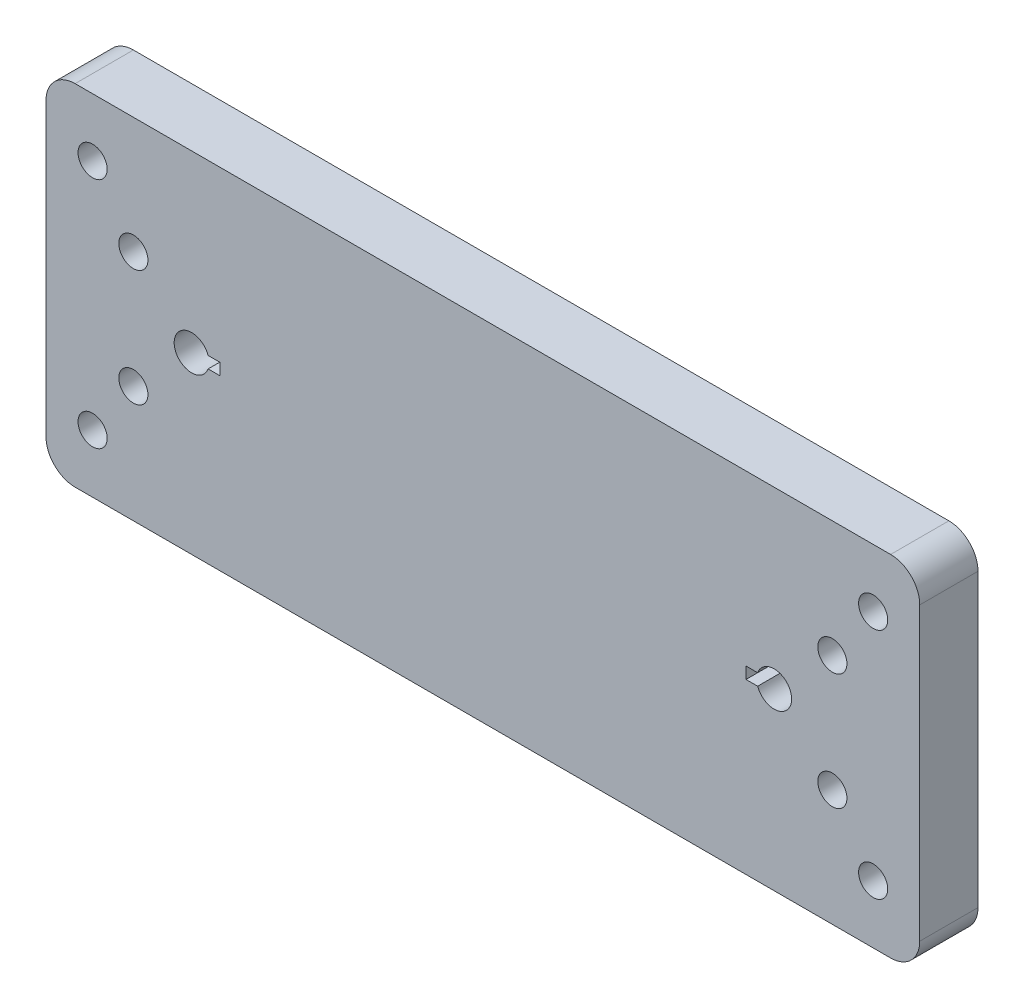
ISO-10303-21;
HEADER;
FILE_DESCRIPTION(('STEP AP214'),'2;1');
FILE_NAME('part.step','',(''),(''),'','','');
FILE_SCHEMA(('AUTOMOTIVE_DESIGN { 1 0 10303 214 1 1 1 1 }'));
ENDSEC;
DATA;
#1=APPLICATION_CONTEXT('core data for automotive mechanical design processes');
#2=APPLICATION_PROTOCOL_DEFINITION('international standard','automotive_design',2000,#1);
#3=PRODUCT_CONTEXT('',#1,'mechanical');
#4=PRODUCT('Part','Part','',(#3));
#5=PRODUCT_RELATED_PRODUCT_CATEGORY('part','',(#4));
#6=PRODUCT_DEFINITION_FORMATION('','',#4);
#7=PRODUCT_DEFINITION_CONTEXT('part definition',#1,'design');
#8=PRODUCT_DEFINITION('design','',#6,#7);
#9=PRODUCT_DEFINITION_SHAPE('','',#8);
#10=(LENGTH_UNIT() NAMED_UNIT(*) SI_UNIT(.MILLI.,.METRE.));
#11=(NAMED_UNIT(*) PLANE_ANGLE_UNIT() SI_UNIT($,.RADIAN.));
#12=(NAMED_UNIT(*) SI_UNIT($,.STERADIAN.) SOLID_ANGLE_UNIT());
#13=UNCERTAINTY_MEASURE_WITH_UNIT(LENGTH_MEASURE(1.E-05),#10,'distance_accuracy_value','');
#14=(GEOMETRIC_REPRESENTATION_CONTEXT(3) GLOBAL_UNCERTAINTY_ASSIGNED_CONTEXT((#13)) GLOBAL_UNIT_ASSIGNED_CONTEXT((#10,
#11,#12)) REPRESENTATION_CONTEXT('',''));
#15=CARTESIAN_POINT('',(0.,0.,0.));
#16=DIRECTION('',(0.,0.,1.));
#17=DIRECTION('',(1.,0.,0.));
#18=AXIS2_PLACEMENT_3D('',#15,#16,#17);
#19=CARTESIAN_POINT('',(145.,5.,10.));
#20=DIRECTION('',(0.,0.,1.));
#21=DIRECTION('',(1.,0.,0.));
#22=AXIS2_PLACEMENT_3D('',#19,#20,#21);
#23=PLANE('',#22);
#24=CARTESIAN_POINT('',(8.00000000000001,10.,10.));
#25=DIRECTION('',(0.,0.,1.));
#26=DIRECTION('',(1.,0.,0.));
#27=AXIS2_PLACEMENT_3D('',#24,#25,#26);
#28=CIRCLE('',#27,2.5);
#29=CARTESIAN_POINT('',(10.5,10.,10.));
#30=VERTEX_POINT('',#29);
#31=EDGE_CURVE('E422',#30,#30,#28,.T.);
#32=ORIENTED_EDGE('',*,*,#31,.F.);
#33=EDGE_LOOP('',(#32));
#34=FACE_BOUND('',#33,.T.);
#35=CARTESIAN_POINT('',(142.,50.,10.));
#36=DIRECTION('',(0.,0.,1.));
#37=DIRECTION('',(1.,0.,0.));
#38=AXIS2_PLACEMENT_3D('',#35,#36,#37);
#39=CIRCLE('',#38,2.5);
#40=CARTESIAN_POINT('',(144.5,50.,10.));
#41=VERTEX_POINT('',#40);
#42=EDGE_CURVE('E415',#41,#41,#39,.T.);
#43=ORIENTED_EDGE('',*,*,#42,.F.);
#44=EDGE_LOOP('',(#43));
#45=FACE_BOUND('',#44,.T.);
#46=CARTESIAN_POINT('',(142.,10.,10.));
#47=DIRECTION('',(0.,0.,1.));
#48=DIRECTION('',(1.,0.,0.));
#49=AXIS2_PLACEMENT_3D('',#46,#47,#48);
#50=CIRCLE('',#49,2.5);
#51=CARTESIAN_POINT('',(144.5,10.,10.));
#52=VERTEX_POINT('',#51);
#53=EDGE_CURVE('E412',#52,#52,#50,.T.);
#54=ORIENTED_EDGE('',*,*,#53,.F.);
#55=EDGE_LOOP('',(#54));
#56=FACE_BOUND('',#55,.T.);
#57=CARTESIAN_POINT('',(8.,50.,10.));
#58=DIRECTION('',(0.,0.,1.));
#59=DIRECTION('',(1.,0.,0.));
#60=AXIS2_PLACEMENT_3D('',#57,#58,#59);
#61=CIRCLE('',#60,2.5);
#62=CARTESIAN_POINT('',(10.5,50.,10.));
#63=VERTEX_POINT('',#62);
#64=EDGE_CURVE('E421',#63,#63,#61,.T.);
#65=ORIENTED_EDGE('',*,*,#64,.F.);
#66=EDGE_LOOP('',(#65));
#67=FACE_BOUND('',#66,.T.);
#68=CARTESIAN_POINT('',(15.,20.,10.));
#69=DIRECTION('',(0.,0.,1.));
#70=DIRECTION('',(1.,0.,0.));
#71=AXIS2_PLACEMENT_3D('',#68,#69,#70);
#72=CIRCLE('',#71,2.5);
#73=CARTESIAN_POINT('',(17.5,20.,10.));
#74=VERTEX_POINT('',#73);
#75=EDGE_CURVE('E446',#74,#74,#72,.T.);
#76=ORIENTED_EDGE('',*,*,#75,.F.);
#77=EDGE_LOOP('',(#76));
#78=FACE_BOUND('',#77,.T.);
#79=CARTESIAN_POINT('',(135.,40.,10.));
#80=DIRECTION('',(0.,0.,1.));
#81=DIRECTION('',(1.,0.,0.));
#82=AXIS2_PLACEMENT_3D('',#79,#80,#81);
#83=CIRCLE('',#82,2.5);
#84=CARTESIAN_POINT('',(137.5,40.,10.));
#85=VERTEX_POINT('',#84);
#86=EDGE_CURVE('E439',#85,#85,#83,.T.);
#87=ORIENTED_EDGE('',*,*,#86,.F.);
#88=EDGE_LOOP('',(#87));
#89=FACE_BOUND('',#88,.T.);
#90=CARTESIAN_POINT('',(135.,20.,10.));
#91=DIRECTION('',(0.,0.,1.));
#92=DIRECTION('',(1.,0.,0.));
#93=AXIS2_PLACEMENT_3D('',#90,#91,#92);
#94=CIRCLE('',#93,2.5);
#95=CARTESIAN_POINT('',(137.5,20.,10.));
#96=VERTEX_POINT('',#95);
#97=EDGE_CURVE('E433',#96,#96,#94,.T.);
#98=ORIENTED_EDGE('',*,*,#97,.F.);
#99=EDGE_LOOP('',(#98));
#100=FACE_BOUND('',#99,.T.);
#101=CARTESIAN_POINT('',(15.,40.,10.));
#102=DIRECTION('',(0.,0.,1.));
#103=DIRECTION('',(1.,0.,0.));
#104=AXIS2_PLACEMENT_3D('',#101,#102,#103);
#105=CIRCLE('',#104,2.5);
#106=CARTESIAN_POINT('',(17.5,40.,10.));
#107=VERTEX_POINT('',#106);
#108=EDGE_CURVE('E445',#107,#107,#105,.T.);
#109=ORIENTED_EDGE('',*,*,#108,.F.);
#110=EDGE_LOOP('',(#109));
#111=FACE_BOUND('',#110,.T.);
#112=CARTESIAN_POINT('',(145.,5.,10.));
#113=DIRECTION('',(0.,0.,1.));
#114=DIRECTION('',(1.,0.,0.));
#115=AXIS2_PLACEMENT_3D('',#112,#113,#114);
#116=CIRCLE('',#115,5.);
#117=CARTESIAN_POINT('',(145.,0.,10.));
#118=VERTEX_POINT('',#117);
#119=CARTESIAN_POINT('',(150.,5.00000000000004,10.));
#120=VERTEX_POINT('',#119);
#121=EDGE_CURVE('E215',#118,#120,#116,.T.);
#122=ORIENTED_EDGE('',*,*,#121,.T.);
#123=DIRECTION('',(0.,1.,0.));
#124=VECTOR('',#123,1.);
#125=CARTESIAN_POINT('',(150.,5.00000000000004,10.));
#126=LINE('',#125,#124);
#127=CARTESIAN_POINT('',(150.,55.,10.));
#128=VERTEX_POINT('',#127);
#129=EDGE_CURVE('E218',#120,#128,#126,.T.);
#130=ORIENTED_EDGE('',*,*,#129,.T.);
#131=CARTESIAN_POINT('',(145.,55.,10.));
#132=DIRECTION('',(0.,0.,1.));
#133=DIRECTION('',(-1.,0.,0.));
#134=AXIS2_PLACEMENT_3D('',#131,#132,#133);
#135=CIRCLE('',#134,5.);
#136=CARTESIAN_POINT('',(145.,60.,10.));
#137=VERTEX_POINT('',#136);
#138=EDGE_CURVE('E221',#128,#137,#135,.T.);
#139=ORIENTED_EDGE('',*,*,#138,.T.);
#140=DIRECTION('',(-1.,0.,0.));
#141=VECTOR('',#140,1.);
#142=CARTESIAN_POINT('',(5.00000000000004,60.,10.));
#143=LINE('',#142,#141);
#144=CARTESIAN_POINT('',(5.00000000000004,60.,10.));
#145=VERTEX_POINT('',#144);
#146=EDGE_CURVE('E223',#137,#145,#143,.T.);
#147=ORIENTED_EDGE('',*,*,#146,.T.);
#148=CARTESIAN_POINT('',(5.,55.,10.));
#149=DIRECTION('',(0.,0.,1.));
#150=DIRECTION('',(-1.,0.,0.));
#151=AXIS2_PLACEMENT_3D('',#148,#149,#150);
#152=CIRCLE('',#151,5.);
#153=CARTESIAN_POINT('',(0.,55.,10.));
#154=VERTEX_POINT('',#153);
#155=EDGE_CURVE('E225',#145,#154,#152,.T.);
#156=ORIENTED_EDGE('',*,*,#155,.T.);
#157=DIRECTION('',(0.,-1.,0.));
#158=VECTOR('',#157,1.);
#159=CARTESIAN_POINT('',(0.,5.00000000000004,10.));
#160=LINE('',#159,#158);
#161=CARTESIAN_POINT('',(0.,5.,10.));
#162=VERTEX_POINT('',#161);
#163=EDGE_CURVE('E227',#154,#162,#160,.T.);
#164=ORIENTED_EDGE('',*,*,#163,.T.);
#165=CARTESIAN_POINT('',(5.,5.,10.));
#166=DIRECTION('',(0.,0.,1.));
#167=DIRECTION('',(-1.,0.,0.));
#168=AXIS2_PLACEMENT_3D('',#165,#166,#167);
#169=CIRCLE('',#168,5.);
#170=CARTESIAN_POINT('',(5.00000000000004,0.,10.));
#171=VERTEX_POINT('',#170);
#172=EDGE_CURVE('E229',#162,#171,#169,.T.);
#173=ORIENTED_EDGE('',*,*,#172,.T.);
#174=DIRECTION('',(1.,0.,0.));
#175=VECTOR('',#174,1.);
#176=CARTESIAN_POINT('',(5.00000000000004,0.,10.));
#177=LINE('',#176,#175);
#178=EDGE_CURVE('E231',#171,#118,#177,.T.);
#179=ORIENTED_EDGE('',*,*,#178,.T.);
#180=EDGE_LOOP('',(#122,#130,#139,#147,#156,#164,#173,#179));
#181=FACE_BOUND('',#180,.T.);
#182=DIRECTION('',(-1.,0.,0.));
#183=VECTOR('',#182,1.);
#184=CARTESIAN_POINT('',(122.171572875254,31.,10.));
#185=LINE('',#184,#183);
#186=CARTESIAN_POINT('',(122.171572875254,31.,10.));
#187=VERTEX_POINT('',#186);
#188=CARTESIAN_POINT('',(120.171572875254,31.,10.));
#189=VERTEX_POINT('',#188);
#190=EDGE_CURVE('E186',#187,#189,#185,.T.);
#191=ORIENTED_EDGE('',*,*,#190,.F.);
#192=CARTESIAN_POINT('',(125.,30.,10.));
#193=DIRECTION('',(0.,0.,1.));
#194=DIRECTION('',(1.,0.,0.));
#195=AXIS2_PLACEMENT_3D('',#192,#193,#194);
#196=CIRCLE('',#195,3.);
#197=CARTESIAN_POINT('',(122.171572875254,29.,10.));
#198=VERTEX_POINT('',#197);
#199=EDGE_CURVE('E184',#198,#187,#196,.T.);
#200=ORIENTED_EDGE('',*,*,#199,.F.);
#201=DIRECTION('',(1.,0.,0.));
#202=VECTOR('',#201,1.);
#203=CARTESIAN_POINT('',(122.171572875254,29.,10.));
#204=LINE('',#203,#202);
#205=CARTESIAN_POINT('',(120.171572875254,29.,10.));
#206=VERTEX_POINT('',#205);
#207=EDGE_CURVE('E192',#206,#198,#204,.T.);
#208=ORIENTED_EDGE('',*,*,#207,.F.);
#209=DIRECTION('',(0.,-1.,0.));
#210=VECTOR('',#209,1.);
#211=CARTESIAN_POINT('',(120.171572875254,31.,10.));
#212=LINE('',#211,#210);
#213=EDGE_CURVE('E189',#189,#206,#212,.T.);
#214=ORIENTED_EDGE('',*,*,#213,.F.);
#215=EDGE_LOOP('',(#191,#200,#208,#214));
#216=FACE_BOUND('',#215,.T.);
#217=DIRECTION('',(1.,0.,0.));
#218=VECTOR('',#217,1.);
#219=CARTESIAN_POINT('',(27.8284271247462,29.,10.));
#220=LINE('',#219,#218);
#221=CARTESIAN_POINT('',(27.8284271247462,29.,10.));
#222=VERTEX_POINT('',#221);
#223=CARTESIAN_POINT('',(29.8284271247462,29.,10.));
#224=VERTEX_POINT('',#223);
#225=EDGE_CURVE('E154',#222,#224,#220,.T.);
#226=ORIENTED_EDGE('',*,*,#225,.F.);
#227=CARTESIAN_POINT('',(25.,30.,10.));
#228=DIRECTION('',(0.,0.,1.));
#229=DIRECTION('',(1.,0.,0.));
#230=AXIS2_PLACEMENT_3D('',#227,#228,#229);
#231=CIRCLE('',#230,3.);
#232=CARTESIAN_POINT('',(27.8284271247462,31.,10.));
#233=VERTEX_POINT('',#232);
#234=EDGE_CURVE('E146',#233,#222,#231,.T.);
#235=ORIENTED_EDGE('',*,*,#234,.F.);
#236=DIRECTION('',(-1.,0.,0.));
#237=VECTOR('',#236,1.);
#238=CARTESIAN_POINT('',(27.8284271247462,31.,10.));
#239=LINE('',#238,#237);
#240=CARTESIAN_POINT('',(29.8284271247462,31.,10.));
#241=VERTEX_POINT('',#240);
#242=EDGE_CURVE('E168',#241,#233,#239,.T.);
#243=ORIENTED_EDGE('',*,*,#242,.F.);
#244=DIRECTION('',(0.,1.,0.));
#245=VECTOR('',#244,1.);
#246=CARTESIAN_POINT('',(29.8284271247462,31.,10.));
#247=LINE('',#246,#245);
#248=EDGE_CURVE('E166',#224,#241,#247,.T.);
#249=ORIENTED_EDGE('',*,*,#248,.F.);
#250=EDGE_LOOP('',(#226,#235,#243,#249));
#251=FACE_BOUND('',#250,.T.);
#252=ADVANCED_FACE('F33',(#34,#45,#56,#67,#78,#89,#100,#111,#181,#216,#251),#23,.T.);
#253=CARTESIAN_POINT('',(145.,5.,0.));
#254=DIRECTION('',(0.,0.,1.));
#255=DIRECTION('',(1.,0.,0.));
#256=AXIS2_PLACEMENT_3D('',#253,#254,#255);
#257=PLANE('',#256);
#258=CARTESIAN_POINT('',(8.00000000000001,10.,0.));
#259=DIRECTION('',(0.,0.,1.));
#260=DIRECTION('',(1.,0.,0.));
#261=AXIS2_PLACEMENT_3D('',#258,#259,#260);
#262=CIRCLE('',#261,2.5);
#263=CARTESIAN_POINT('',(10.5,10.,0.));
#264=VERTEX_POINT('',#263);
#265=EDGE_CURVE('E418',#264,#264,#262,.T.);
#266=ORIENTED_EDGE('',*,*,#265,.T.);
#267=EDGE_LOOP('',(#266));
#268=FACE_BOUND('',#267,.T.);
#269=CARTESIAN_POINT('',(142.,50.,0.));
#270=DIRECTION('',(0.,0.,1.));
#271=DIRECTION('',(1.,0.,0.));
#272=AXIS2_PLACEMENT_3D('',#269,#270,#271);
#273=CIRCLE('',#272,2.5);
#274=CARTESIAN_POINT('',(144.5,50.,0.));
#275=VERTEX_POINT('',#274);
#276=EDGE_CURVE('E425',#275,#275,#273,.T.);
#277=ORIENTED_EDGE('',*,*,#276,.T.);
#278=EDGE_LOOP('',(#277));
#279=FACE_BOUND('',#278,.T.);
#280=CARTESIAN_POINT('',(142.,10.,0.));
#281=DIRECTION('',(0.,0.,1.));
#282=DIRECTION('',(1.,0.,0.));
#283=AXIS2_PLACEMENT_3D('',#280,#281,#282);
#284=CIRCLE('',#283,2.5);
#285=CARTESIAN_POINT('',(144.5,10.,0.));
#286=VERTEX_POINT('',#285);
#287=EDGE_CURVE('E409',#286,#286,#284,.T.);
#288=ORIENTED_EDGE('',*,*,#287,.T.);
#289=EDGE_LOOP('',(#288));
#290=FACE_BOUND('',#289,.T.);
#291=CARTESIAN_POINT('',(8.,50.,0.));
#292=DIRECTION('',(0.,0.,1.));
#293=DIRECTION('',(1.,0.,0.));
#294=AXIS2_PLACEMENT_3D('',#291,#292,#293);
#295=CIRCLE('',#294,2.5);
#296=CARTESIAN_POINT('',(10.5,50.,0.));
#297=VERTEX_POINT('',#296);
#298=EDGE_CURVE('E430',#297,#297,#295,.T.);
#299=ORIENTED_EDGE('',*,*,#298,.T.);
#300=EDGE_LOOP('',(#299));
#301=FACE_BOUND('',#300,.T.);
#302=CARTESIAN_POINT('',(15.,20.,0.));
#303=DIRECTION('',(0.,0.,1.));
#304=DIRECTION('',(1.,0.,0.));
#305=AXIS2_PLACEMENT_3D('',#302,#303,#304);
#306=CIRCLE('',#305,2.5);
#307=CARTESIAN_POINT('',(17.5,20.,0.));
#308=VERTEX_POINT('',#307);
#309=EDGE_CURVE('E442',#308,#308,#306,.T.);
#310=ORIENTED_EDGE('',*,*,#309,.T.);
#311=EDGE_LOOP('',(#310));
#312=FACE_BOUND('',#311,.T.);
#313=CARTESIAN_POINT('',(135.,40.,0.));
#314=DIRECTION('',(0.,0.,1.));
#315=DIRECTION('',(1.,0.,0.));
#316=AXIS2_PLACEMENT_3D('',#313,#314,#315);
#317=CIRCLE('',#316,2.5);
#318=CARTESIAN_POINT('',(137.5,40.,0.));
#319=VERTEX_POINT('',#318);
#320=EDGE_CURVE('E449',#319,#319,#317,.T.);
#321=ORIENTED_EDGE('',*,*,#320,.T.);
#322=EDGE_LOOP('',(#321));
#323=FACE_BOUND('',#322,.T.);
#324=CARTESIAN_POINT('',(135.,20.,0.));
#325=DIRECTION('',(0.,0.,1.));
#326=DIRECTION('',(1.,0.,0.));
#327=AXIS2_PLACEMENT_3D('',#324,#325,#326);
#328=CIRCLE('',#327,2.5);
#329=CARTESIAN_POINT('',(137.5,20.,0.));
#330=VERTEX_POINT('',#329);
#331=EDGE_CURVE('E436',#330,#330,#328,.T.);
#332=ORIENTED_EDGE('',*,*,#331,.T.);
#333=EDGE_LOOP('',(#332));
#334=FACE_BOUND('',#333,.T.);
#335=CARTESIAN_POINT('',(15.,40.,0.));
#336=DIRECTION('',(0.,0.,1.));
#337=DIRECTION('',(1.,0.,0.));
#338=AXIS2_PLACEMENT_3D('',#335,#336,#337);
#339=CIRCLE('',#338,2.5);
#340=CARTESIAN_POINT('',(17.5,40.,0.));
#341=VERTEX_POINT('',#340);
#342=EDGE_CURVE('E174',#341,#341,#339,.T.);
#343=ORIENTED_EDGE('',*,*,#342,.T.);
#344=EDGE_LOOP('',(#343));
#345=FACE_BOUND('',#344,.T.);
#346=CARTESIAN_POINT('',(125.,30.,0.));
#347=DIRECTION('',(0.,0.,1.));
#348=DIRECTION('',(1.,0.,0.));
#349=AXIS2_PLACEMENT_3D('',#346,#347,#348);
#350=CIRCLE('',#349,3.);
#351=CARTESIAN_POINT('',(122.171572875254,29.,0.));
#352=VERTEX_POINT('',#351);
#353=CARTESIAN_POINT('',(122.171572875254,31.,0.));
#354=VERTEX_POINT('',#353);
#355=EDGE_CURVE('E162',#352,#354,#350,.T.);
#356=ORIENTED_EDGE('',*,*,#355,.T.);
#357=DIRECTION('',(-1.,0.,0.));
#358=VECTOR('',#357,1.);
#359=CARTESIAN_POINT('',(122.171572875254,31.,0.));
#360=LINE('',#359,#358);
#361=CARTESIAN_POINT('',(120.171572875254,31.,0.));
#362=VERTEX_POINT('',#361);
#363=EDGE_CURVE('E197',#354,#362,#360,.T.);
#364=ORIENTED_EDGE('',*,*,#363,.T.);
#365=DIRECTION('',(0.,-1.,0.));
#366=VECTOR('',#365,1.);
#367=CARTESIAN_POINT('',(120.171572875254,31.,0.));
#368=LINE('',#367,#366);
#369=CARTESIAN_POINT('',(120.171572875254,29.,0.));
#370=VERTEX_POINT('',#369);
#371=EDGE_CURVE('E200',#362,#370,#368,.T.);
#372=ORIENTED_EDGE('',*,*,#371,.T.);
#373=DIRECTION('',(1.,0.,0.));
#374=VECTOR('',#373,1.);
#375=CARTESIAN_POINT('',(122.171572875254,29.,0.));
#376=LINE('',#375,#374);
#377=EDGE_CURVE('E187',#370,#352,#376,.T.);
#378=ORIENTED_EDGE('',*,*,#377,.T.);
#379=EDGE_LOOP('',(#356,#364,#372,#378));
#380=FACE_BOUND('',#379,.T.);
#381=CARTESIAN_POINT('',(145.,5.,0.));
#382=DIRECTION('',(0.,0.,1.));
#383=DIRECTION('',(1.,0.,0.));
#384=AXIS2_PLACEMENT_3D('',#381,#382,#383);
#385=CIRCLE('',#384,5.);
#386=CARTESIAN_POINT('',(145.,0.,0.));
#387=VERTEX_POINT('',#386);
#388=CARTESIAN_POINT('',(150.,5.00000000000004,0.));
#389=VERTEX_POINT('',#388);
#390=EDGE_CURVE('E214',#387,#389,#385,.T.);
#391=ORIENTED_EDGE('',*,*,#390,.F.);
#392=DIRECTION('',(1.,0.,0.));
#393=VECTOR('',#392,1.);
#394=CARTESIAN_POINT('',(5.00000000000004,0.,0.));
#395=LINE('',#394,#393);
#396=CARTESIAN_POINT('',(5.00000000000004,0.,0.));
#397=VERTEX_POINT('',#396);
#398=EDGE_CURVE('E219',#397,#387,#395,.T.);
#399=ORIENTED_EDGE('',*,*,#398,.F.);
#400=CARTESIAN_POINT('',(5.,5.,0.));
#401=DIRECTION('',(0.,0.,1.));
#402=DIRECTION('',(-1.,0.,0.));
#403=AXIS2_PLACEMENT_3D('',#400,#401,#402);
#404=CIRCLE('',#403,5.);
#405=CARTESIAN_POINT('',(0.,5.,0.));
#406=VERTEX_POINT('',#405);
#407=EDGE_CURVE('E246',#406,#397,#404,.T.);
#408=ORIENTED_EDGE('',*,*,#407,.F.);
#409=DIRECTION('',(0.,-1.,0.));
#410=VECTOR('',#409,1.);
#411=CARTESIAN_POINT('',(0.,5.00000000000004,0.));
#412=LINE('',#411,#410);
#413=CARTESIAN_POINT('',(0.,55.,0.));
#414=VERTEX_POINT('',#413);
#415=EDGE_CURVE('E244',#414,#406,#412,.T.);
#416=ORIENTED_EDGE('',*,*,#415,.F.);
#417=CARTESIAN_POINT('',(5.,55.,0.));
#418=DIRECTION('',(0.,0.,1.));
#419=DIRECTION('',(-1.,0.,0.));
#420=AXIS2_PLACEMENT_3D('',#417,#418,#419);
#421=CIRCLE('',#420,5.);
#422=CARTESIAN_POINT('',(5.00000000000004,60.,0.));
#423=VERTEX_POINT('',#422);
#424=EDGE_CURVE('E242',#423,#414,#421,.T.);
#425=ORIENTED_EDGE('',*,*,#424,.F.);
#426=DIRECTION('',(-1.,0.,0.));
#427=VECTOR('',#426,1.);
#428=CARTESIAN_POINT('',(5.00000000000004,60.,0.));
#429=LINE('',#428,#427);
#430=CARTESIAN_POINT('',(145.,60.,0.));
#431=VERTEX_POINT('',#430);
#432=EDGE_CURVE('E240',#431,#423,#429,.T.);
#433=ORIENTED_EDGE('',*,*,#432,.F.);
#434=CARTESIAN_POINT('',(145.,55.,0.));
#435=DIRECTION('',(0.,0.,1.));
#436=DIRECTION('',(-1.,0.,0.));
#437=AXIS2_PLACEMENT_3D('',#434,#435,#436);
#438=CIRCLE('',#437,5.);
#439=CARTESIAN_POINT('',(150.,55.,0.));
#440=VERTEX_POINT('',#439);
#441=EDGE_CURVE('E238',#440,#431,#438,.T.);
#442=ORIENTED_EDGE('',*,*,#441,.F.);
#443=DIRECTION('',(0.,1.,0.));
#444=VECTOR('',#443,1.);
#445=CARTESIAN_POINT('',(150.,5.00000000000004,0.));
#446=LINE('',#445,#444);
#447=EDGE_CURVE('E236',#389,#440,#446,.T.);
#448=ORIENTED_EDGE('',*,*,#447,.F.);
#449=EDGE_LOOP('',(#391,#399,#408,#416,#425,#433,#442,#448));
#450=FACE_BOUND('',#449,.T.);
#451=CARTESIAN_POINT('',(25.,30.,0.));
#452=DIRECTION('',(0.,0.,1.));
#453=DIRECTION('',(1.,0.,0.));
#454=AXIS2_PLACEMENT_3D('',#451,#452,#453);
#455=CIRCLE('',#454,3.);
#456=CARTESIAN_POINT('',(27.8284271247462,31.,0.));
#457=VERTEX_POINT('',#456);
#458=CARTESIAN_POINT('',(27.8284271247462,29.,0.));
#459=VERTEX_POINT('',#458);
#460=EDGE_CURVE('E56',#457,#459,#455,.T.);
#461=ORIENTED_EDGE('',*,*,#460,.T.);
#462=DIRECTION('',(1.,0.,0.));
#463=VECTOR('',#462,1.);
#464=CARTESIAN_POINT('',(27.8284271247462,29.,0.));
#465=LINE('',#464,#463);
#466=CARTESIAN_POINT('',(29.8284271247462,29.,0.));
#467=VERTEX_POINT('',#466);
#468=EDGE_CURVE('E161',#459,#467,#465,.T.);
#469=ORIENTED_EDGE('',*,*,#468,.T.);
#470=DIRECTION('',(0.,1.,0.));
#471=VECTOR('',#470,1.);
#472=CARTESIAN_POINT('',(29.8284271247462,31.,0.));
#473=LINE('',#472,#471);
#474=CARTESIAN_POINT('',(29.8284271247462,31.,0.));
#475=VERTEX_POINT('',#474);
#476=EDGE_CURVE('E176',#467,#475,#473,.T.);
#477=ORIENTED_EDGE('',*,*,#476,.T.);
#478=DIRECTION('',(-1.,0.,0.));
#479=VECTOR('',#478,1.);
#480=CARTESIAN_POINT('',(27.8284271247462,31.,0.));
#481=LINE('',#480,#479);
#482=EDGE_CURVE('E155',#475,#457,#481,.T.);
#483=ORIENTED_EDGE('',*,*,#482,.T.);
#484=EDGE_LOOP('',(#461,#469,#477,#483));
#485=FACE_BOUND('',#484,.T.);
#486=ADVANCED_FACE('F276',(#268,#279,#290,#301,#312,#323,#334,#345,#380,#450,#485),#257,.F.);
#487=CARTESIAN_POINT('',(145.,5.,10.));
#488=DIRECTION('',(0.,0.,-1.));
#489=DIRECTION('',(-1.,0.,0.));
#490=AXIS2_PLACEMENT_3D('',#487,#488,#489);
#491=CYLINDRICAL_SURFACE('',#490,5.);
#492=ORIENTED_EDGE('',*,*,#390,.T.);
#493=DIRECTION('',(0.,0.,-1.));
#494=VECTOR('',#493,1.);
#495=CARTESIAN_POINT('',(150.,5.00000000000004,10.));
#496=LINE('',#495,#494);
#497=EDGE_CURVE('E11',#120,#389,#496,.T.);
#498=ORIENTED_EDGE('',*,*,#497,.F.);
#499=ORIENTED_EDGE('',*,*,#121,.F.);
#500=DIRECTION('',(0.,0.,-1.));
#501=VECTOR('',#500,1.);
#502=CARTESIAN_POINT('',(145.,0.,10.));
#503=LINE('',#502,#501);
#504=EDGE_CURVE('E233',#118,#387,#503,.T.);
#505=ORIENTED_EDGE('',*,*,#504,.T.);
#506=EDGE_LOOP('',(#492,#498,#499,#505));
#507=FACE_BOUND('',#506,.T.);
#508=ADVANCED_FACE('F35',(#507),#491,.T.);
#509=CARTESIAN_POINT('',(150.,5.00000000000004,10.));
#510=DIRECTION('',(-1.,0.,0.));
#511=DIRECTION('',(0.,0.,1.));
#512=AXIS2_PLACEMENT_3D('',#509,#510,#511);
#513=PLANE('',#512);
#514=ORIENTED_EDGE('',*,*,#447,.T.);
#515=DIRECTION('',(0.,0.,-1.));
#516=VECTOR('',#515,1.);
#517=CARTESIAN_POINT('',(150.,55.,10.));
#518=LINE('',#517,#516);
#519=EDGE_CURVE('E41',#128,#440,#518,.T.);
#520=ORIENTED_EDGE('',*,*,#519,.F.);
#521=ORIENTED_EDGE('',*,*,#129,.F.);
#522=ORIENTED_EDGE('',*,*,#497,.T.);
#523=EDGE_LOOP('',(#514,#520,#521,#522));
#524=FACE_BOUND('',#523,.T.);
#525=ADVANCED_FACE('F294',(#524),#513,.F.);
#526=CARTESIAN_POINT('',(145.,55.,10.));
#527=DIRECTION('',(0.,0.,-1.));
#528=DIRECTION('',(-1.,0.,0.));
#529=AXIS2_PLACEMENT_3D('',#526,#527,#528);
#530=CYLINDRICAL_SURFACE('',#529,5.);
#531=ORIENTED_EDGE('',*,*,#441,.T.);
#532=DIRECTION('',(0.,0.,-1.));
#533=VECTOR('',#532,1.);
#534=CARTESIAN_POINT('',(145.,60.,10.));
#535=LINE('',#534,#533);
#536=EDGE_CURVE('E263',#137,#431,#535,.T.);
#537=ORIENTED_EDGE('',*,*,#536,.F.);
#538=ORIENTED_EDGE('',*,*,#138,.F.);
#539=ORIENTED_EDGE('',*,*,#519,.T.);
#540=EDGE_LOOP('',(#531,#537,#538,#539));
#541=FACE_BOUND('',#540,.T.);
#542=ADVANCED_FACE('F270',(#541),#530,.T.);
#543=CARTESIAN_POINT('',(5.00000000000004,60.,10.));
#544=DIRECTION('',(0.,-1.,0.));
#545=DIRECTION('',(0.,0.,-1.));
#546=AXIS2_PLACEMENT_3D('',#543,#544,#545);
#547=PLANE('',#546);
#548=ORIENTED_EDGE('',*,*,#432,.T.);
#549=DIRECTION('',(0.,0.,-1.));
#550=VECTOR('',#549,1.);
#551=CARTESIAN_POINT('',(5.00000000000004,60.,10.));
#552=LINE('',#551,#550);
#553=EDGE_CURVE('E260',#145,#423,#552,.T.);
#554=ORIENTED_EDGE('',*,*,#553,.F.);
#555=ORIENTED_EDGE('',*,*,#146,.F.);
#556=ORIENTED_EDGE('',*,*,#536,.T.);
#557=EDGE_LOOP('',(#548,#554,#555,#556));
#558=FACE_BOUND('',#557,.T.);
#559=ADVANCED_FACE('F282',(#558),#547,.F.);
#560=CARTESIAN_POINT('',(5.,55.,10.));
#561=DIRECTION('',(0.,0.,-1.));
#562=DIRECTION('',(-1.,0.,0.));
#563=AXIS2_PLACEMENT_3D('',#560,#561,#562);
#564=CYLINDRICAL_SURFACE('',#563,5.);
#565=ORIENTED_EDGE('',*,*,#424,.T.);
#566=DIRECTION('',(0.,0.,-1.));
#567=VECTOR('',#566,1.);
#568=CARTESIAN_POINT('',(0.,55.,10.));
#569=LINE('',#568,#567);
#570=EDGE_CURVE('E257',#154,#414,#569,.T.);
#571=ORIENTED_EDGE('',*,*,#570,.F.);
#572=ORIENTED_EDGE('',*,*,#155,.F.);
#573=ORIENTED_EDGE('',*,*,#553,.T.);
#574=EDGE_LOOP('',(#565,#571,#572,#573));
#575=FACE_BOUND('',#574,.T.);
#576=ADVANCED_FACE('F286',(#575),#564,.T.);
#577=CARTESIAN_POINT('',(0.,5.00000000000004,10.));
#578=DIRECTION('',(1.,0.,0.));
#579=DIRECTION('',(0.,0.,-1.));
#580=AXIS2_PLACEMENT_3D('',#577,#578,#579);
#581=PLANE('',#580);
#582=ORIENTED_EDGE('',*,*,#415,.T.);
#583=DIRECTION('',(0.,0.,-1.));
#584=VECTOR('',#583,1.);
#585=CARTESIAN_POINT('',(0.,5.,10.));
#586=LINE('',#585,#584);
#587=EDGE_CURVE('E254',#162,#406,#586,.T.);
#588=ORIENTED_EDGE('',*,*,#587,.F.);
#589=ORIENTED_EDGE('',*,*,#163,.F.);
#590=ORIENTED_EDGE('',*,*,#570,.T.);
#591=EDGE_LOOP('',(#582,#588,#589,#590));
#592=FACE_BOUND('',#591,.T.);
#593=ADVANCED_FACE('F307',(#592),#581,.F.);
#594=CARTESIAN_POINT('',(5.,5.,10.));
#595=DIRECTION('',(0.,0.,-1.));
#596=DIRECTION('',(-1.,0.,0.));
#597=AXIS2_PLACEMENT_3D('',#594,#595,#596);
#598=CYLINDRICAL_SURFACE('',#597,5.);
#599=ORIENTED_EDGE('',*,*,#407,.T.);
#600=DIRECTION('',(0.,0.,-1.));
#601=VECTOR('',#600,1.);
#602=CARTESIAN_POINT('',(5.00000000000004,0.,10.));
#603=LINE('',#602,#601);
#604=EDGE_CURVE('E251',#171,#397,#603,.T.);
#605=ORIENTED_EDGE('',*,*,#604,.F.);
#606=ORIENTED_EDGE('',*,*,#172,.F.);
#607=ORIENTED_EDGE('',*,*,#587,.T.);
#608=EDGE_LOOP('',(#599,#605,#606,#607));
#609=FACE_BOUND('',#608,.T.);
#610=ADVANCED_FACE('F305',(#609),#598,.T.);
#611=CARTESIAN_POINT('',(5.00000000000004,0.,10.));
#612=DIRECTION('',(0.,1.,0.));
#613=DIRECTION('',(0.,0.,1.));
#614=AXIS2_PLACEMENT_3D('',#611,#612,#613);
#615=PLANE('',#614);
#616=ORIENTED_EDGE('',*,*,#398,.T.);
#617=ORIENTED_EDGE('',*,*,#504,.F.);
#618=ORIENTED_EDGE('',*,*,#178,.F.);
#619=ORIENTED_EDGE('',*,*,#604,.T.);
#620=EDGE_LOOP('',(#616,#617,#618,#619));
#621=FACE_BOUND('',#620,.T.);
#622=ADVANCED_FACE('F300',(#621),#615,.F.);
#623=CARTESIAN_POINT('',(125.,30.,10.));
#624=DIRECTION('',(0.,0.,-1.));
#625=DIRECTION('',(-1.,0.,0.));
#626=AXIS2_PLACEMENT_3D('',#623,#624,#625);
#627=CYLINDRICAL_SURFACE('',#626,3.);
#628=ORIENTED_EDGE('',*,*,#355,.F.);
#629=DIRECTION('',(0.,0.,-1.));
#630=VECTOR('',#629,1.);
#631=CARTESIAN_POINT('',(122.171572875254,29.,10.));
#632=LINE('',#631,#630);
#633=EDGE_CURVE('E194',#198,#352,#632,.T.);
#634=ORIENTED_EDGE('',*,*,#633,.F.);
#635=ORIENTED_EDGE('',*,*,#199,.T.);
#636=DIRECTION('',(0.,0.,-1.));
#637=VECTOR('',#636,1.);
#638=CARTESIAN_POINT('',(122.171572875254,31.,10.));
#639=LINE('',#638,#637);
#640=EDGE_CURVE('E211',#187,#354,#639,.T.);
#641=ORIENTED_EDGE('',*,*,#640,.T.);
#642=EDGE_LOOP('',(#628,#634,#635,#641));
#643=FACE_BOUND('',#642,.T.);
#644=ADVANCED_FACE('F328',(#643),#627,.F.);
#645=CARTESIAN_POINT('',(122.171572875254,31.,10.));
#646=DIRECTION('',(0.,-1.,0.));
#647=DIRECTION('',(1.,0.,0.));
#648=AXIS2_PLACEMENT_3D('',#645,#646,#647);
#649=PLANE('',#648);
#650=ORIENTED_EDGE('',*,*,#363,.F.);
#651=ORIENTED_EDGE('',*,*,#640,.F.);
#652=ORIENTED_EDGE('',*,*,#190,.T.);
#653=DIRECTION('',(0.,0.,-1.));
#654=VECTOR('',#653,1.);
#655=CARTESIAN_POINT('',(120.171572875254,31.,10.));
#656=LINE('',#655,#654);
#657=EDGE_CURVE('E209',#189,#362,#656,.T.);
#658=ORIENTED_EDGE('',*,*,#657,.T.);
#659=EDGE_LOOP('',(#650,#651,#652,#658));
#660=FACE_BOUND('',#659,.T.);
#661=ADVANCED_FACE('F335',(#660),#649,.T.);
#662=CARTESIAN_POINT('',(120.171572875254,31.,10.));
#663=DIRECTION('',(1.,0.,0.));
#664=DIRECTION('',(0.,0.,-1.));
#665=AXIS2_PLACEMENT_3D('',#662,#663,#664);
#666=PLANE('',#665);
#667=ORIENTED_EDGE('',*,*,#371,.F.);
#668=ORIENTED_EDGE('',*,*,#657,.F.);
#669=ORIENTED_EDGE('',*,*,#213,.T.);
#670=DIRECTION('',(0.,0.,-1.));
#671=VECTOR('',#670,1.);
#672=CARTESIAN_POINT('',(120.171572875254,29.,10.));
#673=LINE('',#672,#671);
#674=EDGE_CURVE('E207',#206,#370,#673,.T.);
#675=ORIENTED_EDGE('',*,*,#674,.T.);
#676=EDGE_LOOP('',(#667,#668,#669,#675));
#677=FACE_BOUND('',#676,.T.);
#678=ADVANCED_FACE('F340',(#677),#666,.T.);
#679=CARTESIAN_POINT('',(122.171572875254,29.,10.));
#680=DIRECTION('',(0.,1.,0.));
#681=DIRECTION('',(-1.,0.,0.));
#682=AXIS2_PLACEMENT_3D('',#679,#680,#681);
#683=PLANE('',#682);
#684=ORIENTED_EDGE('',*,*,#377,.F.);
#685=ORIENTED_EDGE('',*,*,#674,.F.);
#686=ORIENTED_EDGE('',*,*,#207,.T.);
#687=ORIENTED_EDGE('',*,*,#633,.T.);
#688=EDGE_LOOP('',(#684,#685,#686,#687));
#689=FACE_BOUND('',#688,.T.);
#690=ADVANCED_FACE('F348',(#689),#683,.T.);
#691=CARTESIAN_POINT('',(25.,30.,10.));
#692=DIRECTION('',(0.,0.,-1.));
#693=DIRECTION('',(-1.,0.,0.));
#694=AXIS2_PLACEMENT_3D('',#691,#692,#693);
#695=CYLINDRICAL_SURFACE('',#694,3.);
#696=ORIENTED_EDGE('',*,*,#460,.F.);
#697=DIRECTION('',(0.,0.,-1.));
#698=VECTOR('',#697,1.);
#699=CARTESIAN_POINT('',(27.8284271247462,31.,10.));
#700=LINE('',#699,#698);
#701=EDGE_CURVE('E150',#233,#457,#700,.T.);
#702=ORIENTED_EDGE('',*,*,#701,.F.);
#703=ORIENTED_EDGE('',*,*,#234,.T.);
#704=DIRECTION('',(0.,0.,-1.));
#705=VECTOR('',#704,1.);
#706=CARTESIAN_POINT('',(27.8284271247462,29.,10.));
#707=LINE('',#706,#705);
#708=EDGE_CURVE('E149',#222,#459,#707,.T.);
#709=ORIENTED_EDGE('',*,*,#708,.T.);
#710=EDGE_LOOP('',(#696,#702,#703,#709));
#711=FACE_BOUND('',#710,.T.);
#712=ADVANCED_FACE('F148',(#711),#695,.F.);
#713=CARTESIAN_POINT('',(27.8284271247462,29.,10.));
#714=DIRECTION('',(0.,1.,0.));
#715=DIRECTION('',(0.,0.,1.));
#716=AXIS2_PLACEMENT_3D('',#713,#714,#715);
#717=PLANE('',#716);
#718=ORIENTED_EDGE('',*,*,#468,.F.);
#719=ORIENTED_EDGE('',*,*,#708,.F.);
#720=ORIENTED_EDGE('',*,*,#225,.T.);
#721=DIRECTION('',(0.,0.,-1.));
#722=VECTOR('',#721,1.);
#723=CARTESIAN_POINT('',(29.8284271247462,29.,10.));
#724=LINE('',#723,#722);
#725=EDGE_CURVE('E163',#224,#467,#724,.T.);
#726=ORIENTED_EDGE('',*,*,#725,.T.);
#727=EDGE_LOOP('',(#718,#719,#720,#726));
#728=FACE_BOUND('',#727,.T.);
#729=ADVANCED_FACE('F158',(#728),#717,.T.);
#730=CARTESIAN_POINT('',(29.8284271247462,31.,10.));
#731=DIRECTION('',(-1.,0.,0.));
#732=DIRECTION('',(0.,0.,1.));
#733=AXIS2_PLACEMENT_3D('',#730,#731,#732);
#734=PLANE('',#733);
#735=ORIENTED_EDGE('',*,*,#476,.F.);
#736=ORIENTED_EDGE('',*,*,#725,.F.);
#737=ORIENTED_EDGE('',*,*,#248,.T.);
#738=DIRECTION('',(0.,0.,-1.));
#739=VECTOR('',#738,1.);
#740=CARTESIAN_POINT('',(29.8284271247462,31.,10.));
#741=LINE('',#740,#739);
#742=EDGE_CURVE('E48',#241,#475,#741,.T.);
#743=ORIENTED_EDGE('',*,*,#742,.T.);
#744=EDGE_LOOP('',(#735,#736,#737,#743));
#745=FACE_BOUND('',#744,.T.);
#746=ADVANCED_FACE('F366',(#745),#734,.T.);
#747=CARTESIAN_POINT('',(27.8284271247462,31.,10.));
#748=DIRECTION('',(0.,-1.,0.));
#749=DIRECTION('',(1.,0.,0.));
#750=AXIS2_PLACEMENT_3D('',#747,#748,#749);
#751=PLANE('',#750);
#752=ORIENTED_EDGE('',*,*,#482,.F.);
#753=ORIENTED_EDGE('',*,*,#742,.F.);
#754=ORIENTED_EDGE('',*,*,#242,.T.);
#755=ORIENTED_EDGE('',*,*,#701,.T.);
#756=EDGE_LOOP('',(#752,#753,#754,#755));
#757=FACE_BOUND('',#756,.T.);
#758=ADVANCED_FACE('F369',(#757),#751,.T.);
#759=CARTESIAN_POINT('',(15.,40.,0.));
#760=DIRECTION('',(0.,0.,1.));
#761=DIRECTION('',(1.,0.,0.));
#762=AXIS2_PLACEMENT_3D('',#759,#760,#761);
#763=CYLINDRICAL_SURFACE('',#762,2.5);
#764=ORIENTED_EDGE('',*,*,#342,.F.);
#765=EDGE_LOOP('',(#764));
#766=FACE_BOUND('',#765,.T.);
#767=ORIENTED_EDGE('',*,*,#108,.T.);
#768=EDGE_LOOP('',(#767));
#769=FACE_BOUND('',#768,.T.);
#770=ADVANCED_FACE('F373',(#766,#769),#763,.F.);
#771=CARTESIAN_POINT('',(135.,20.,0.));
#772=DIRECTION('',(0.,0.,1.));
#773=DIRECTION('',(1.,0.,0.));
#774=AXIS2_PLACEMENT_3D('',#771,#772,#773);
#775=CYLINDRICAL_SURFACE('',#774,2.5);
#776=ORIENTED_EDGE('',*,*,#331,.F.);
#777=EDGE_LOOP('',(#776));
#778=FACE_BOUND('',#777,.T.);
#779=ORIENTED_EDGE('',*,*,#97,.T.);
#780=EDGE_LOOP('',(#779));
#781=FACE_BOUND('',#780,.T.);
#782=ADVANCED_FACE('F376',(#778,#781),#775,.F.);
#783=CARTESIAN_POINT('',(135.,40.,0.));
#784=DIRECTION('',(0.,0.,1.));
#785=DIRECTION('',(1.,0.,0.));
#786=AXIS2_PLACEMENT_3D('',#783,#784,#785);
#787=CYLINDRICAL_SURFACE('',#786,2.5);
#788=ORIENTED_EDGE('',*,*,#320,.F.);
#789=EDGE_LOOP('',(#788));
#790=FACE_BOUND('',#789,.T.);
#791=ORIENTED_EDGE('',*,*,#86,.T.);
#792=EDGE_LOOP('',(#791));
#793=FACE_BOUND('',#792,.T.);
#794=ADVANCED_FACE('F378',(#790,#793),#787,.F.);
#795=CARTESIAN_POINT('',(15.,20.,0.));
#796=DIRECTION('',(0.,0.,1.));
#797=DIRECTION('',(1.,0.,0.));
#798=AXIS2_PLACEMENT_3D('',#795,#796,#797);
#799=CYLINDRICAL_SURFACE('',#798,2.5);
#800=ORIENTED_EDGE('',*,*,#309,.F.);
#801=EDGE_LOOP('',(#800));
#802=FACE_BOUND('',#801,.T.);
#803=ORIENTED_EDGE('',*,*,#75,.T.);
#804=EDGE_LOOP('',(#803));
#805=FACE_BOUND('',#804,.T.);
#806=ADVANCED_FACE('F381',(#802,#805),#799,.F.);
#807=CARTESIAN_POINT('',(8.,50.,0.));
#808=DIRECTION('',(0.,0.,1.));
#809=DIRECTION('',(1.,0.,0.));
#810=AXIS2_PLACEMENT_3D('',#807,#808,#809);
#811=CYLINDRICAL_SURFACE('',#810,2.5);
#812=ORIENTED_EDGE('',*,*,#298,.F.);
#813=EDGE_LOOP('',(#812));
#814=FACE_BOUND('',#813,.T.);
#815=ORIENTED_EDGE('',*,*,#64,.T.);
#816=EDGE_LOOP('',(#815));
#817=FACE_BOUND('',#816,.T.);
#818=ADVANCED_FACE('F385',(#814,#817),#811,.F.);
#819=CARTESIAN_POINT('',(142.,10.,0.));
#820=DIRECTION('',(0.,0.,1.));
#821=DIRECTION('',(1.,0.,0.));
#822=AXIS2_PLACEMENT_3D('',#819,#820,#821);
#823=CYLINDRICAL_SURFACE('',#822,2.5);
#824=ORIENTED_EDGE('',*,*,#287,.F.);
#825=EDGE_LOOP('',(#824));
#826=FACE_BOUND('',#825,.T.);
#827=ORIENTED_EDGE('',*,*,#53,.T.);
#828=EDGE_LOOP('',(#827));
#829=FACE_BOUND('',#828,.T.);
#830=ADVANCED_FACE('F392',(#826,#829),#823,.F.);
#831=CARTESIAN_POINT('',(142.,50.,0.));
#832=DIRECTION('',(0.,0.,1.));
#833=DIRECTION('',(1.,0.,0.));
#834=AXIS2_PLACEMENT_3D('',#831,#832,#833);
#835=CYLINDRICAL_SURFACE('',#834,2.5);
#836=ORIENTED_EDGE('',*,*,#276,.F.);
#837=EDGE_LOOP('',(#836));
#838=FACE_BOUND('',#837,.T.);
#839=ORIENTED_EDGE('',*,*,#42,.T.);
#840=EDGE_LOOP('',(#839));
#841=FACE_BOUND('',#840,.T.);
#842=ADVANCED_FACE('F394',(#838,#841),#835,.F.);
#843=CARTESIAN_POINT('',(8.00000000000001,10.,0.));
#844=DIRECTION('',(0.,0.,1.));
#845=DIRECTION('',(1.,0.,0.));
#846=AXIS2_PLACEMENT_3D('',#843,#844,#845);
#847=CYLINDRICAL_SURFACE('',#846,2.5);
#848=ORIENTED_EDGE('',*,*,#265,.F.);
#849=EDGE_LOOP('',(#848));
#850=FACE_BOUND('',#849,.T.);
#851=ORIENTED_EDGE('',*,*,#31,.T.);
#852=EDGE_LOOP('',(#851));
#853=FACE_BOUND('',#852,.T.);
#854=ADVANCED_FACE('F397',(#850,#853),#847,.F.);
#855=CLOSED_SHELL('',(#252,#486,#508,#525,#542,#559,#576,#593,#610,#622,#644,#661,#678,#690,
#712,#729,#746,#758,#770,#782,#794,#806,#818,#830,#842,#854));
#856=MANIFOLD_SOLID_BREP('B2',#855);
#857=ADVANCED_BREP_SHAPE_REPRESENTATION('',(#18,#856),#14);
#858=SHAPE_DEFINITION_REPRESENTATION(#9,#857);
ENDSEC;
END-ISO-10303-21;
